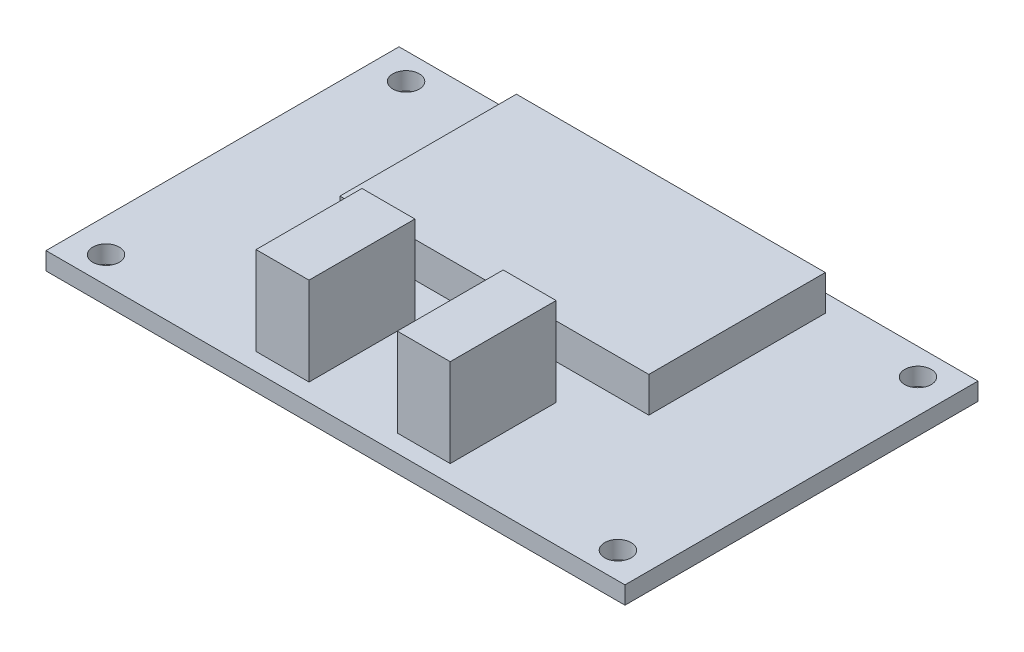
ISO-10303-21;
HEADER;
FILE_DESCRIPTION(('STEP AP214'),'2;1');
FILE_NAME('part.step','',(''),(''),'','','');
FILE_SCHEMA(('AUTOMOTIVE_DESIGN { 1 0 10303 214 1 1 1 1 }'));
ENDSEC;
DATA;
#1=APPLICATION_CONTEXT('core data for automotive mechanical design processes');
#2=APPLICATION_PROTOCOL_DEFINITION('international standard','automotive_design',2000,#1);
#3=PRODUCT_CONTEXT('',#1,'mechanical');
#4=PRODUCT('Part','Part','',(#3));
#5=PRODUCT_RELATED_PRODUCT_CATEGORY('part','',(#4));
#6=PRODUCT_DEFINITION_FORMATION('','',#4);
#7=PRODUCT_DEFINITION_CONTEXT('part definition',#1,'design');
#8=PRODUCT_DEFINITION('design','',#6,#7);
#9=PRODUCT_DEFINITION_SHAPE('','',#8);
#10=(LENGTH_UNIT() NAMED_UNIT(*) SI_UNIT(.MILLI.,.METRE.));
#11=(NAMED_UNIT(*) PLANE_ANGLE_UNIT() SI_UNIT($,.RADIAN.));
#12=(NAMED_UNIT(*) SI_UNIT($,.STERADIAN.) SOLID_ANGLE_UNIT());
#13=UNCERTAINTY_MEASURE_WITH_UNIT(LENGTH_MEASURE(1.E-05),#10,'distance_accuracy_value','');
#14=(GEOMETRIC_REPRESENTATION_CONTEXT(3) GLOBAL_UNCERTAINTY_ASSIGNED_CONTEXT((#13)) GLOBAL_UNIT_ASSIGNED_CONTEXT((#10,
#11,#12)) REPRESENTATION_CONTEXT('',''));
#15=CARTESIAN_POINT('',(0.,0.,0.));
#16=DIRECTION('',(0.,0.,1.));
#17=DIRECTION('',(1.,0.,0.));
#18=AXIS2_PLACEMENT_3D('',#15,#16,#17);
#19=CARTESIAN_POINT('',(0.,2.,0.));
#20=DIRECTION('',(0.,-1.,0.));
#21=DIRECTION('',(0.,0.,-1.));
#22=AXIS2_PLACEMENT_3D('',#19,#20,#21);
#23=PLANE('',#22);
#24=DIRECTION('',(0.,0.,-1.));
#25=VECTOR('',#24,1.);
#26=CARTESIAN_POINT('',(-5.,2.,18.));
#27=LINE('',#26,#25);
#28=CARTESIAN_POINT('',(-5.,2.,18.));
#29=VERTEX_POINT('',#28);
#30=CARTESIAN_POINT('',(-5.,2.,6.));
#31=VERTEX_POINT('',#30);
#32=EDGE_CURVE('E169',#29,#31,#27,.T.);
#33=ORIENTED_EDGE('',*,*,#32,.F.);
#34=DIRECTION('',(1.,0.,0.));
#35=VECTOR('',#34,1.);
#36=CARTESIAN_POINT('',(-11.,2.,18.));
#37=LINE('',#36,#35);
#38=CARTESIAN_POINT('',(-11.,2.,18.));
#39=VERTEX_POINT('',#38);
#40=EDGE_CURVE('E182',#39,#29,#37,.T.);
#41=ORIENTED_EDGE('',*,*,#40,.F.);
#42=DIRECTION('',(0.,0.,1.));
#43=VECTOR('',#42,1.);
#44=CARTESIAN_POINT('',(-11.,2.,18.));
#45=LINE('',#44,#43);
#46=CARTESIAN_POINT('',(-11.,2.,6.));
#47=VERTEX_POINT('',#46);
#48=EDGE_CURVE('E191',#47,#39,#45,.T.);
#49=ORIENTED_EDGE('',*,*,#48,.F.);
#50=DIRECTION('',(-1.,0.,0.));
#51=VECTOR('',#50,1.);
#52=CARTESIAN_POINT('',(-11.,2.,6.));
#53=LINE('',#52,#51);
#54=EDGE_CURVE('E172',#31,#47,#53,.T.);
#55=ORIENTED_EDGE('',*,*,#54,.F.);
#56=EDGE_LOOP('',(#33,#41,#49,#55));
#57=FACE_BOUND('',#56,.T.);
#58=DIRECTION('',(0.,0.,-1.));
#59=VECTOR('',#58,1.);
#60=CARTESIAN_POINT('',(32.8,2.,20.));
#61=LINE('',#60,#59);
#62=CARTESIAN_POINT('',(32.8,2.,20.));
#63=VERTEX_POINT('',#62);
#64=CARTESIAN_POINT('',(32.8,2.,-20.));
#65=VERTEX_POINT('',#64);
#66=EDGE_CURVE('E265',#63,#65,#61,.T.);
#67=ORIENTED_EDGE('',*,*,#66,.T.);
#68=DIRECTION('',(-1.,0.,0.));
#69=VECTOR('',#68,1.);
#70=CARTESIAN_POINT('',(-32.8,2.,-20.));
#71=LINE('',#70,#69);
#72=CARTESIAN_POINT('',(-32.8,2.,-20.));
#73=VERTEX_POINT('',#72);
#74=EDGE_CURVE('E268',#65,#73,#71,.T.);
#75=ORIENTED_EDGE('',*,*,#74,.T.);
#76=DIRECTION('',(0.,0.,1.));
#77=VECTOR('',#76,1.);
#78=CARTESIAN_POINT('',(-32.8,2.,20.));
#79=LINE('',#78,#77);
#80=CARTESIAN_POINT('',(-32.8,2.,20.));
#81=VERTEX_POINT('',#80);
#82=EDGE_CURVE('E271',#73,#81,#79,.T.);
#83=ORIENTED_EDGE('',*,*,#82,.T.);
#84=DIRECTION('',(1.,0.,0.));
#85=VECTOR('',#84,1.);
#86=CARTESIAN_POINT('',(-32.8,2.,20.));
#87=LINE('',#86,#85);
#88=EDGE_CURVE('E273',#81,#63,#87,.T.);
#89=ORIENTED_EDGE('',*,*,#88,.T.);
#90=EDGE_LOOP('',(#67,#75,#83,#89));
#91=FACE_BOUND('',#90,.T.);
#92=CARTESIAN_POINT('',(-29.,2.,-17.));
#93=DIRECTION('',(0.,1.,0.));
#94=DIRECTION('',(0.,0.,1.));
#95=AXIS2_PLACEMENT_3D('',#92,#93,#94);
#96=CIRCLE('',#95,1.5);
#97=CARTESIAN_POINT('',(-29.,2.,-15.5));
#98=VERTEX_POINT('',#97);
#99=EDGE_CURVE('E244',#98,#98,#96,.T.);
#100=ORIENTED_EDGE('',*,*,#99,.F.);
#101=EDGE_LOOP('',(#100));
#102=FACE_BOUND('',#101,.T.);
#103=CARTESIAN_POINT('',(29.,2.,-17.));
#104=DIRECTION('',(0.,1.,0.));
#105=DIRECTION('',(0.,0.,1.));
#106=AXIS2_PLACEMENT_3D('',#103,#104,#105);
#107=CIRCLE('',#106,1.5);
#108=CARTESIAN_POINT('',(29.,2.,-15.5));
#109=VERTEX_POINT('',#108);
#110=EDGE_CURVE('E245',#109,#109,#107,.T.);
#111=ORIENTED_EDGE('',*,*,#110,.F.);
#112=EDGE_LOOP('',(#111));
#113=FACE_BOUND('',#112,.T.);
#114=CARTESIAN_POINT('',(29.,2.,17.));
#115=DIRECTION('',(0.,1.,0.));
#116=DIRECTION('',(0.,0.,1.));
#117=AXIS2_PLACEMENT_3D('',#114,#115,#116);
#118=CIRCLE('',#117,1.5);
#119=CARTESIAN_POINT('',(29.,2.,18.5));
#120=VERTEX_POINT('',#119);
#121=EDGE_CURVE('E251',#120,#120,#118,.T.);
#122=ORIENTED_EDGE('',*,*,#121,.F.);
#123=EDGE_LOOP('',(#122));
#124=FACE_BOUND('',#123,.T.);
#125=CARTESIAN_POINT('',(-29.,2.,17.));
#126=DIRECTION('',(0.,1.,0.));
#127=DIRECTION('',(0.,0.,1.));
#128=AXIS2_PLACEMENT_3D('',#125,#126,#127);
#129=CIRCLE('',#128,1.5);
#130=CARTESIAN_POINT('',(-29.,2.,18.5));
#131=VERTEX_POINT('',#130);
#132=EDGE_CURVE('E240',#131,#131,#129,.T.);
#133=ORIENTED_EDGE('',*,*,#132,.F.);
#134=EDGE_LOOP('',(#133));
#135=FACE_BOUND('',#134,.T.);
#136=DIRECTION('',(0.,0.,-1.));
#137=VECTOR('',#136,1.);
#138=CARTESIAN_POINT('',(17.5,2.,2.));
#139=LINE('',#138,#137);
#140=CARTESIAN_POINT('',(17.5,2.,2.));
#141=VERTEX_POINT('',#140);
#142=CARTESIAN_POINT('',(17.5,2.,-18.));
#143=VERTEX_POINT('',#142);
#144=EDGE_CURVE('E207',#141,#143,#139,.T.);
#145=ORIENTED_EDGE('',*,*,#144,.F.);
#146=DIRECTION('',(1.,0.,0.));
#147=VECTOR('',#146,1.);
#148=CARTESIAN_POINT('',(-17.5,2.,2.));
#149=LINE('',#148,#147);
#150=CARTESIAN_POINT('',(-17.5,2.,2.));
#151=VERTEX_POINT('',#150);
#152=EDGE_CURVE('E212',#151,#141,#149,.T.);
#153=ORIENTED_EDGE('',*,*,#152,.F.);
#154=DIRECTION('',(0.,0.,1.));
#155=VECTOR('',#154,1.);
#156=CARTESIAN_POINT('',(-17.5,2.,2.));
#157=LINE('',#156,#155);
#158=CARTESIAN_POINT('',(-17.5,2.,-18.));
#159=VERTEX_POINT('',#158);
#160=EDGE_CURVE('E224',#159,#151,#157,.T.);
#161=ORIENTED_EDGE('',*,*,#160,.F.);
#162=DIRECTION('',(-1.,0.,0.));
#163=VECTOR('',#162,1.);
#164=CARTESIAN_POINT('',(-17.5,2.,-18.));
#165=LINE('',#164,#163);
#166=EDGE_CURVE('E221',#143,#159,#165,.T.);
#167=ORIENTED_EDGE('',*,*,#166,.F.);
#168=EDGE_LOOP('',(#145,#153,#161,#167));
#169=FACE_BOUND('',#168,.T.);
#170=DIRECTION('',(0.,0.,-1.));
#171=VECTOR('',#170,1.);
#172=CARTESIAN_POINT('',(11.,2.,18.));
#173=LINE('',#172,#171);
#174=CARTESIAN_POINT('',(11.,2.,18.));
#175=VERTEX_POINT('',#174);
#176=CARTESIAN_POINT('',(11.,2.,6.));
#177=VERTEX_POINT('',#176);
#178=EDGE_CURVE('E168',#175,#177,#173,.T.);
#179=ORIENTED_EDGE('',*,*,#178,.F.);
#180=DIRECTION('',(1.,0.,0.));
#181=VECTOR('',#180,1.);
#182=CARTESIAN_POINT('',(5.,2.,18.));
#183=LINE('',#182,#181);
#184=CARTESIAN_POINT('',(5.,2.,18.));
#185=VERTEX_POINT('',#184);
#186=EDGE_CURVE('E165',#185,#175,#183,.T.);
#187=ORIENTED_EDGE('',*,*,#186,.F.);
#188=DIRECTION('',(0.,0.,1.));
#189=VECTOR('',#188,1.);
#190=CARTESIAN_POINT('',(5.,2.,18.));
#191=LINE('',#190,#189);
#192=CARTESIAN_POINT('',(5.,2.,6.));
#193=VERTEX_POINT('',#192);
#194=EDGE_CURVE('E55',#193,#185,#191,.T.);
#195=ORIENTED_EDGE('',*,*,#194,.F.);
#196=DIRECTION('',(-1.,0.,0.));
#197=VECTOR('',#196,1.);
#198=CARTESIAN_POINT('',(5.,2.,6.));
#199=LINE('',#198,#197);
#200=EDGE_CURVE('E50',#177,#193,#199,.T.);
#201=ORIENTED_EDGE('',*,*,#200,.F.);
#202=EDGE_LOOP('',(#179,#187,#195,#201));
#203=FACE_BOUND('',#202,.T.);
#204=ADVANCED_FACE('F35',(#57,#91,#102,#113,#124,#135,#169,#203),#23,.F.);
#205=CARTESIAN_POINT('',(32.8,2.,20.));
#206=DIRECTION('',(-1.,0.,0.));
#207=DIRECTION('',(0.,0.,1.));
#208=AXIS2_PLACEMENT_3D('',#205,#206,#207);
#209=PLANE('',#208);
#210=DIRECTION('',(0.,0.,-1.));
#211=VECTOR('',#210,1.);
#212=CARTESIAN_POINT('',(32.8,0.,20.));
#213=LINE('',#212,#211);
#214=CARTESIAN_POINT('',(32.8,0.,20.));
#215=VERTEX_POINT('',#214);
#216=CARTESIAN_POINT('',(32.8,0.,-20.));
#217=VERTEX_POINT('',#216);
#218=EDGE_CURVE('E262',#215,#217,#213,.T.);
#219=ORIENTED_EDGE('',*,*,#218,.T.);
#220=DIRECTION('',(0.,-1.,0.));
#221=VECTOR('',#220,1.);
#222=CARTESIAN_POINT('',(32.8,2.,-20.));
#223=LINE('',#222,#221);
#224=EDGE_CURVE('E11',#65,#217,#223,.T.);
#225=ORIENTED_EDGE('',*,*,#224,.F.);
#226=ORIENTED_EDGE('',*,*,#66,.F.);
#227=DIRECTION('',(0.,-1.,0.));
#228=VECTOR('',#227,1.);
#229=CARTESIAN_POINT('',(32.8,2.,20.));
#230=LINE('',#229,#228);
#231=EDGE_CURVE('E275',#63,#215,#230,.T.);
#232=ORIENTED_EDGE('',*,*,#231,.T.);
#233=EDGE_LOOP('',(#219,#225,#226,#232));
#234=FACE_BOUND('',#233,.T.);
#235=ADVANCED_FACE('F37',(#234),#209,.F.);
#236=CARTESIAN_POINT('',(-32.8,2.,-20.));
#237=DIRECTION('',(0.,0.,1.));
#238=DIRECTION('',(1.,0.,0.));
#239=AXIS2_PLACEMENT_3D('',#236,#237,#238);
#240=PLANE('',#239);
#241=DIRECTION('',(-1.,0.,0.));
#242=VECTOR('',#241,1.);
#243=CARTESIAN_POINT('',(-32.8,0.,-20.));
#244=LINE('',#243,#242);
#245=CARTESIAN_POINT('',(-32.8,0.,-20.));
#246=VERTEX_POINT('',#245);
#247=EDGE_CURVE('E278',#217,#246,#244,.T.);
#248=ORIENTED_EDGE('',*,*,#247,.T.);
#249=DIRECTION('',(0.,-1.,0.));
#250=VECTOR('',#249,1.);
#251=CARTESIAN_POINT('',(-32.8,2.,-20.));
#252=LINE('',#251,#250);
#253=EDGE_CURVE('E43',#73,#246,#252,.T.);
#254=ORIENTED_EDGE('',*,*,#253,.F.);
#255=ORIENTED_EDGE('',*,*,#74,.F.);
#256=ORIENTED_EDGE('',*,*,#224,.T.);
#257=EDGE_LOOP('',(#248,#254,#255,#256));
#258=FACE_BOUND('',#257,.T.);
#259=ADVANCED_FACE('F308',(#258),#240,.F.);
#260=CARTESIAN_POINT('',(-32.8,2.,20.));
#261=DIRECTION('',(1.,0.,0.));
#262=DIRECTION('',(0.,0.,-1.));
#263=AXIS2_PLACEMENT_3D('',#260,#261,#262);
#264=PLANE('',#263);
#265=DIRECTION('',(0.,0.,1.));
#266=VECTOR('',#265,1.);
#267=CARTESIAN_POINT('',(-32.8,0.,20.));
#268=LINE('',#267,#266);
#269=CARTESIAN_POINT('',(-32.8,0.,20.));
#270=VERTEX_POINT('',#269);
#271=EDGE_CURVE('E280',#246,#270,#268,.T.);
#272=ORIENTED_EDGE('',*,*,#271,.T.);
#273=DIRECTION('',(0.,-1.,0.));
#274=VECTOR('',#273,1.);
#275=CARTESIAN_POINT('',(-32.8,2.,20.));
#276=LINE('',#275,#274);
#277=EDGE_CURVE('E285',#81,#270,#276,.T.);
#278=ORIENTED_EDGE('',*,*,#277,.F.);
#279=ORIENTED_EDGE('',*,*,#82,.F.);
#280=ORIENTED_EDGE('',*,*,#253,.T.);
#281=EDGE_LOOP('',(#272,#278,#279,#280));
#282=FACE_BOUND('',#281,.T.);
#283=ADVANCED_FACE('F292',(#282),#264,.F.);
#284=CARTESIAN_POINT('',(-32.8,2.,20.));
#285=DIRECTION('',(0.,0.,-1.));
#286=DIRECTION('',(-1.,0.,0.));
#287=AXIS2_PLACEMENT_3D('',#284,#285,#286);
#288=PLANE('',#287);
#289=DIRECTION('',(1.,0.,0.));
#290=VECTOR('',#289,1.);
#291=CARTESIAN_POINT('',(-32.8,0.,20.));
#292=LINE('',#291,#290);
#293=EDGE_CURVE('E269',#270,#215,#292,.T.);
#294=ORIENTED_EDGE('',*,*,#293,.T.);
#295=ORIENTED_EDGE('',*,*,#231,.F.);
#296=ORIENTED_EDGE('',*,*,#88,.F.);
#297=ORIENTED_EDGE('',*,*,#277,.T.);
#298=EDGE_LOOP('',(#294,#295,#296,#297));
#299=FACE_BOUND('',#298,.T.);
#300=ADVANCED_FACE('F301',(#299),#288,.F.);
#301=CARTESIAN_POINT('',(0.,0.,0.));
#302=DIRECTION('',(0.,-1.,0.));
#303=DIRECTION('',(0.,0.,-1.));
#304=AXIS2_PLACEMENT_3D('',#301,#302,#303);
#305=PLANE('',#304);
#306=CARTESIAN_POINT('',(-29.,0.,17.));
#307=DIRECTION('',(0.,1.,0.));
#308=DIRECTION('',(0.,0.,1.));
#309=AXIS2_PLACEMENT_3D('',#306,#307,#308);
#310=CIRCLE('',#309,1.5);
#311=CARTESIAN_POINT('',(-29.,0.,18.5));
#312=VERTEX_POINT('',#311);
#313=EDGE_CURVE('E254',#312,#312,#310,.T.);
#314=ORIENTED_EDGE('',*,*,#313,.T.);
#315=EDGE_LOOP('',(#314));
#316=FACE_BOUND('',#315,.T.);
#317=CARTESIAN_POINT('',(29.,0.,17.));
#318=DIRECTION('',(0.,1.,0.));
#319=DIRECTION('',(0.,0.,1.));
#320=AXIS2_PLACEMENT_3D('',#317,#318,#319);
#321=CIRCLE('',#320,1.5);
#322=CARTESIAN_POINT('',(29.,0.,18.5));
#323=VERTEX_POINT('',#322);
#324=EDGE_CURVE('E248',#323,#323,#321,.T.);
#325=ORIENTED_EDGE('',*,*,#324,.T.);
#326=EDGE_LOOP('',(#325));
#327=FACE_BOUND('',#326,.T.);
#328=CARTESIAN_POINT('',(29.,0.,-17.));
#329=DIRECTION('',(0.,1.,0.));
#330=DIRECTION('',(0.,0.,1.));
#331=AXIS2_PLACEMENT_3D('',#328,#329,#330);
#332=CIRCLE('',#331,1.5);
#333=CARTESIAN_POINT('',(29.,0.,-15.5));
#334=VERTEX_POINT('',#333);
#335=EDGE_CURVE('E241',#334,#334,#332,.T.);
#336=ORIENTED_EDGE('',*,*,#335,.T.);
#337=EDGE_LOOP('',(#336));
#338=FACE_BOUND('',#337,.T.);
#339=CARTESIAN_POINT('',(-29.,0.,-17.));
#340=DIRECTION('',(0.,1.,0.));
#341=DIRECTION('',(0.,0.,1.));
#342=AXIS2_PLACEMENT_3D('',#339,#340,#341);
#343=CIRCLE('',#342,1.5);
#344=CARTESIAN_POINT('',(-29.,0.,-15.5));
#345=VERTEX_POINT('',#344);
#346=EDGE_CURVE('E259',#345,#345,#343,.T.);
#347=ORIENTED_EDGE('',*,*,#346,.T.);
#348=EDGE_LOOP('',(#347));
#349=FACE_BOUND('',#348,.T.);
#350=ORIENTED_EDGE('',*,*,#218,.F.);
#351=ORIENTED_EDGE('',*,*,#293,.F.);
#352=ORIENTED_EDGE('',*,*,#271,.F.);
#353=ORIENTED_EDGE('',*,*,#247,.F.);
#354=EDGE_LOOP('',(#350,#351,#352,#353));
#355=FACE_BOUND('',#354,.T.);
#356=ADVANCED_FACE('F298',(#316,#327,#338,#349,#355),#305,.T.);
#357=CARTESIAN_POINT('',(-29.,0.,-17.));
#358=DIRECTION('',(0.,1.,0.));
#359=DIRECTION('',(0.,0.,1.));
#360=AXIS2_PLACEMENT_3D('',#357,#358,#359);
#361=CYLINDRICAL_SURFACE('',#360,1.5);
#362=ORIENTED_EDGE('',*,*,#346,.F.);
#363=EDGE_LOOP('',(#362));
#364=FACE_BOUND('',#363,.T.);
#365=ORIENTED_EDGE('',*,*,#99,.T.);
#366=EDGE_LOOP('',(#365));
#367=FACE_BOUND('',#366,.T.);
#368=ADVANCED_FACE('F322',(#364,#367),#361,.F.);
#369=CARTESIAN_POINT('',(29.,0.,-17.));
#370=DIRECTION('',(0.,1.,0.));
#371=DIRECTION('',(0.,0.,1.));
#372=AXIS2_PLACEMENT_3D('',#369,#370,#371);
#373=CYLINDRICAL_SURFACE('',#372,1.5);
#374=ORIENTED_EDGE('',*,*,#335,.F.);
#375=EDGE_LOOP('',(#374));
#376=FACE_BOUND('',#375,.T.);
#377=ORIENTED_EDGE('',*,*,#110,.T.);
#378=EDGE_LOOP('',(#377));
#379=FACE_BOUND('',#378,.T.);
#380=ADVANCED_FACE('F342',(#376,#379),#373,.F.);
#381=CARTESIAN_POINT('',(29.,0.,17.));
#382=DIRECTION('',(0.,1.,0.));
#383=DIRECTION('',(0.,0.,1.));
#384=AXIS2_PLACEMENT_3D('',#381,#382,#383);
#385=CYLINDRICAL_SURFACE('',#384,1.5);
#386=ORIENTED_EDGE('',*,*,#324,.F.);
#387=EDGE_LOOP('',(#386));
#388=FACE_BOUND('',#387,.T.);
#389=ORIENTED_EDGE('',*,*,#121,.T.);
#390=EDGE_LOOP('',(#389));
#391=FACE_BOUND('',#390,.T.);
#392=ADVANCED_FACE('F349',(#388,#391),#385,.F.);
#393=CARTESIAN_POINT('',(-29.,0.,17.));
#394=DIRECTION('',(0.,1.,0.));
#395=DIRECTION('',(0.,0.,1.));
#396=AXIS2_PLACEMENT_3D('',#393,#394,#395);
#397=CYLINDRICAL_SURFACE('',#396,1.5);
#398=ORIENTED_EDGE('',*,*,#313,.F.);
#399=EDGE_LOOP('',(#398));
#400=FACE_BOUND('',#399,.T.);
#401=ORIENTED_EDGE('',*,*,#132,.T.);
#402=EDGE_LOOP('',(#401));
#403=FACE_BOUND('',#402,.T.);
#404=ADVANCED_FACE('F357',(#400,#403),#397,.F.);
#405=CARTESIAN_POINT('',(17.5,6.,2.));
#406=DIRECTION('',(-1.,0.,0.));
#407=DIRECTION('',(0.,0.,1.));
#408=AXIS2_PLACEMENT_3D('',#405,#406,#407);
#409=PLANE('',#408);
#410=ORIENTED_EDGE('',*,*,#144,.T.);
#411=DIRECTION('',(0.,-1.,0.));
#412=VECTOR('',#411,1.);
#413=CARTESIAN_POINT('',(17.5,6.,-18.));
#414=LINE('',#413,#412);
#415=CARTESIAN_POINT('',(17.5,6.,-18.));
#416=VERTEX_POINT('',#415);
#417=EDGE_CURVE('E237',#416,#143,#414,.T.);
#418=ORIENTED_EDGE('',*,*,#417,.F.);
#419=DIRECTION('',(0.,0.,-1.));
#420=VECTOR('',#419,1.);
#421=CARTESIAN_POINT('',(17.5,6.,2.));
#422=LINE('',#421,#420);
#423=CARTESIAN_POINT('',(17.5,6.,2.));
#424=VERTEX_POINT('',#423);
#425=EDGE_CURVE('E208',#424,#416,#422,.T.);
#426=ORIENTED_EDGE('',*,*,#425,.F.);
#427=DIRECTION('',(0.,-1.,0.));
#428=VECTOR('',#427,1.);
#429=CARTESIAN_POINT('',(17.5,6.,2.));
#430=LINE('',#429,#428);
#431=EDGE_CURVE('E218',#424,#141,#430,.T.);
#432=ORIENTED_EDGE('',*,*,#431,.T.);
#433=EDGE_LOOP('',(#410,#418,#426,#432));
#434=FACE_BOUND('',#433,.T.);
#435=ADVANCED_FACE('F365',(#434),#409,.F.);
#436=CARTESIAN_POINT('',(-17.5,6.,-18.));
#437=DIRECTION('',(0.,0.,1.));
#438=DIRECTION('',(1.,0.,0.));
#439=AXIS2_PLACEMENT_3D('',#436,#437,#438);
#440=PLANE('',#439);
#441=ORIENTED_EDGE('',*,*,#166,.T.);
#442=DIRECTION('',(0.,-1.,0.));
#443=VECTOR('',#442,1.);
#444=CARTESIAN_POINT('',(-17.5,6.,-18.));
#445=LINE('',#444,#443);
#446=CARTESIAN_POINT('',(-17.5,6.,-18.));
#447=VERTEX_POINT('',#446);
#448=EDGE_CURVE('E234',#447,#159,#445,.T.);
#449=ORIENTED_EDGE('',*,*,#448,.F.);
#450=DIRECTION('',(-1.,0.,0.));
#451=VECTOR('',#450,1.);
#452=CARTESIAN_POINT('',(-17.5,6.,-18.));
#453=LINE('',#452,#451);
#454=EDGE_CURVE('E211',#416,#447,#453,.T.);
#455=ORIENTED_EDGE('',*,*,#454,.F.);
#456=ORIENTED_EDGE('',*,*,#417,.T.);
#457=EDGE_LOOP('',(#441,#449,#455,#456));
#458=FACE_BOUND('',#457,.T.);
#459=ADVANCED_FACE('F373',(#458),#440,.F.);
#460=CARTESIAN_POINT('',(-17.5,6.,2.));
#461=DIRECTION('',(1.,0.,0.));
#462=DIRECTION('',(0.,0.,-1.));
#463=AXIS2_PLACEMENT_3D('',#460,#461,#462);
#464=PLANE('',#463);
#465=ORIENTED_EDGE('',*,*,#160,.T.);
#466=DIRECTION('',(0.,-1.,0.));
#467=VECTOR('',#466,1.);
#468=CARTESIAN_POINT('',(-17.5,6.,2.));
#469=LINE('',#468,#467);
#470=CARTESIAN_POINT('',(-17.5,6.,2.));
#471=VERTEX_POINT('',#470);
#472=EDGE_CURVE('E231',#471,#151,#469,.T.);
#473=ORIENTED_EDGE('',*,*,#472,.F.);
#474=DIRECTION('',(0.,0.,1.));
#475=VECTOR('',#474,1.);
#476=CARTESIAN_POINT('',(-17.5,6.,2.));
#477=LINE('',#476,#475);
#478=EDGE_CURVE('E214',#447,#471,#477,.T.);
#479=ORIENTED_EDGE('',*,*,#478,.F.);
#480=ORIENTED_EDGE('',*,*,#448,.T.);
#481=EDGE_LOOP('',(#465,#473,#479,#480));
#482=FACE_BOUND('',#481,.T.);
#483=ADVANCED_FACE('F380',(#482),#464,.F.);
#484=CARTESIAN_POINT('',(-17.5,6.,2.));
#485=DIRECTION('',(0.,0.,-1.));
#486=DIRECTION('',(-1.,0.,0.));
#487=AXIS2_PLACEMENT_3D('',#484,#485,#486);
#488=PLANE('',#487);
#489=ORIENTED_EDGE('',*,*,#152,.T.);
#490=ORIENTED_EDGE('',*,*,#431,.F.);
#491=DIRECTION('',(1.,0.,0.));
#492=VECTOR('',#491,1.);
#493=CARTESIAN_POINT('',(-17.5,6.,2.));
#494=LINE('',#493,#492);
#495=EDGE_CURVE('E216',#471,#424,#494,.T.);
#496=ORIENTED_EDGE('',*,*,#495,.F.);
#497=ORIENTED_EDGE('',*,*,#472,.T.);
#498=EDGE_LOOP('',(#489,#490,#496,#497));
#499=FACE_BOUND('',#498,.T.);
#500=ADVANCED_FACE('F388',(#499),#488,.F.);
#501=CARTESIAN_POINT('',(0.,6.,0.));
#502=DIRECTION('',(0.,-1.,0.));
#503=DIRECTION('',(0.,0.,-1.));
#504=AXIS2_PLACEMENT_3D('',#501,#502,#503);
#505=PLANE('',#504);
#506=ORIENTED_EDGE('',*,*,#425,.T.);
#507=ORIENTED_EDGE('',*,*,#454,.T.);
#508=ORIENTED_EDGE('',*,*,#478,.T.);
#509=ORIENTED_EDGE('',*,*,#495,.T.);
#510=EDGE_LOOP('',(#506,#507,#508,#509));
#511=FACE_BOUND('',#510,.T.);
#512=ADVANCED_FACE('F396',(#511),#505,.F.);
#513=CARTESIAN_POINT('',(-5.,12.,18.));
#514=DIRECTION('',(-1.,0.,0.));
#515=DIRECTION('',(0.,0.,1.));
#516=AXIS2_PLACEMENT_3D('',#513,#514,#515);
#517=PLANE('',#516);
#518=ORIENTED_EDGE('',*,*,#32,.T.);
#519=DIRECTION('',(0.,-1.,0.));
#520=VECTOR('',#519,1.);
#521=CARTESIAN_POINT('',(-5.,12.,6.));
#522=LINE('',#521,#520);
#523=CARTESIAN_POINT('',(-5.,12.,6.));
#524=VERTEX_POINT('',#523);
#525=EDGE_CURVE('E204',#524,#31,#522,.T.);
#526=ORIENTED_EDGE('',*,*,#525,.F.);
#527=DIRECTION('',(0.,0.,-1.));
#528=VECTOR('',#527,1.);
#529=CARTESIAN_POINT('',(-5.,12.,18.));
#530=LINE('',#529,#528);
#531=CARTESIAN_POINT('',(-5.,12.,18.));
#532=VERTEX_POINT('',#531);
#533=EDGE_CURVE('E178',#532,#524,#530,.T.);
#534=ORIENTED_EDGE('',*,*,#533,.F.);
#535=DIRECTION('',(0.,-1.,0.));
#536=VECTOR('',#535,1.);
#537=CARTESIAN_POINT('',(-5.,12.,18.));
#538=LINE('',#537,#536);
#539=EDGE_CURVE('E187',#532,#29,#538,.T.);
#540=ORIENTED_EDGE('',*,*,#539,.T.);
#541=EDGE_LOOP('',(#518,#526,#534,#540));
#542=FACE_BOUND('',#541,.T.);
#543=ADVANCED_FACE('F404',(#542),#517,.F.);
#544=CARTESIAN_POINT('',(-11.,12.,6.));
#545=DIRECTION('',(0.,0.,1.));
#546=DIRECTION('',(1.,0.,0.));
#547=AXIS2_PLACEMENT_3D('',#544,#545,#546);
#548=PLANE('',#547);
#549=ORIENTED_EDGE('',*,*,#54,.T.);
#550=DIRECTION('',(0.,-1.,0.));
#551=VECTOR('',#550,1.);
#552=CARTESIAN_POINT('',(-11.,12.,6.));
#553=LINE('',#552,#551);
#554=CARTESIAN_POINT('',(-11.,12.,6.));
#555=VERTEX_POINT('',#554);
#556=EDGE_CURVE('E201',#555,#47,#553,.T.);
#557=ORIENTED_EDGE('',*,*,#556,.F.);
#558=DIRECTION('',(-1.,0.,0.));
#559=VECTOR('',#558,1.);
#560=CARTESIAN_POINT('',(-11.,12.,6.));
#561=LINE('',#560,#559);
#562=EDGE_CURVE('E181',#524,#555,#561,.T.);
#563=ORIENTED_EDGE('',*,*,#562,.F.);
#564=ORIENTED_EDGE('',*,*,#525,.T.);
#565=EDGE_LOOP('',(#549,#557,#563,#564));
#566=FACE_BOUND('',#565,.T.);
#567=ADVANCED_FACE('F412',(#566),#548,.F.);
#568=CARTESIAN_POINT('',(-11.,12.,18.));
#569=DIRECTION('',(1.,0.,0.));
#570=DIRECTION('',(0.,0.,-1.));
#571=AXIS2_PLACEMENT_3D('',#568,#569,#570);
#572=PLANE('',#571);
#573=ORIENTED_EDGE('',*,*,#48,.T.);
#574=DIRECTION('',(0.,-1.,0.));
#575=VECTOR('',#574,1.);
#576=CARTESIAN_POINT('',(-11.,12.,18.));
#577=LINE('',#576,#575);
#578=CARTESIAN_POINT('',(-11.,12.,18.));
#579=VERTEX_POINT('',#578);
#580=EDGE_CURVE('E198',#579,#39,#577,.T.);
#581=ORIENTED_EDGE('',*,*,#580,.F.);
#582=DIRECTION('',(0.,0.,1.));
#583=VECTOR('',#582,1.);
#584=CARTESIAN_POINT('',(-11.,12.,18.));
#585=LINE('',#584,#583);
#586=EDGE_CURVE('E184',#555,#579,#585,.T.);
#587=ORIENTED_EDGE('',*,*,#586,.F.);
#588=ORIENTED_EDGE('',*,*,#556,.T.);
#589=EDGE_LOOP('',(#573,#581,#587,#588));
#590=FACE_BOUND('',#589,.T.);
#591=ADVANCED_FACE('F420',(#590),#572,.F.);
#592=CARTESIAN_POINT('',(-11.,12.,18.));
#593=DIRECTION('',(0.,0.,-1.));
#594=DIRECTION('',(-1.,0.,0.));
#595=AXIS2_PLACEMENT_3D('',#592,#593,#594);
#596=PLANE('',#595);
#597=ORIENTED_EDGE('',*,*,#40,.T.);
#598=ORIENTED_EDGE('',*,*,#539,.F.);
#599=DIRECTION('',(1.,0.,0.));
#600=VECTOR('',#599,1.);
#601=CARTESIAN_POINT('',(-11.,12.,18.));
#602=LINE('',#601,#600);
#603=EDGE_CURVE('E186',#579,#532,#602,.T.);
#604=ORIENTED_EDGE('',*,*,#603,.F.);
#605=ORIENTED_EDGE('',*,*,#580,.T.);
#606=EDGE_LOOP('',(#597,#598,#604,#605));
#607=FACE_BOUND('',#606,.T.);
#608=ADVANCED_FACE('F428',(#607),#596,.F.);
#609=CARTESIAN_POINT('',(0.,12.,0.));
#610=DIRECTION('',(0.,-1.,0.));
#611=DIRECTION('',(0.,0.,-1.));
#612=AXIS2_PLACEMENT_3D('',#609,#610,#611);
#613=PLANE('',#612);
#614=ORIENTED_EDGE('',*,*,#533,.T.);
#615=ORIENTED_EDGE('',*,*,#562,.T.);
#616=ORIENTED_EDGE('',*,*,#586,.T.);
#617=ORIENTED_EDGE('',*,*,#603,.T.);
#618=EDGE_LOOP('',(#614,#615,#616,#617));
#619=FACE_BOUND('',#618,.T.);
#620=ADVANCED_FACE('F436',(#619),#613,.F.);
#621=CARTESIAN_POINT('',(11.,12.,18.));
#622=DIRECTION('',(-1.,0.,0.));
#623=DIRECTION('',(0.,0.,1.));
#624=AXIS2_PLACEMENT_3D('',#621,#622,#623);
#625=PLANE('',#624);
#626=ORIENTED_EDGE('',*,*,#178,.T.);
#627=DIRECTION('',(0.,-1.,0.));
#628=VECTOR('',#627,1.);
#629=CARTESIAN_POINT('',(11.,12.,6.));
#630=LINE('',#629,#628);
#631=CARTESIAN_POINT('',(11.,12.,6.));
#632=VERTEX_POINT('',#631);
#633=EDGE_CURVE('E149',#632,#177,#630,.T.);
#634=ORIENTED_EDGE('',*,*,#633,.F.);
#635=DIRECTION('',(0.,0.,-1.));
#636=VECTOR('',#635,1.);
#637=CARTESIAN_POINT('',(11.,12.,18.));
#638=LINE('',#637,#636);
#639=CARTESIAN_POINT('',(11.,12.,18.));
#640=VERTEX_POINT('',#639);
#641=EDGE_CURVE('E156',#640,#632,#638,.T.);
#642=ORIENTED_EDGE('',*,*,#641,.F.);
#643=DIRECTION('',(0.,-1.,0.));
#644=VECTOR('',#643,1.);
#645=CARTESIAN_POINT('',(11.,12.,18.));
#646=LINE('',#645,#644);
#647=EDGE_CURVE('E553',#640,#175,#646,.T.);
#648=ORIENTED_EDGE('',*,*,#647,.T.);
#649=EDGE_LOOP('',(#626,#634,#642,#648));
#650=FACE_BOUND('',#649,.T.);
#651=ADVANCED_FACE('F167',(#650),#625,.F.);
#652=CARTESIAN_POINT('',(5.,12.,6.));
#653=DIRECTION('',(0.,0.,1.));
#654=DIRECTION('',(1.,0.,0.));
#655=AXIS2_PLACEMENT_3D('',#652,#653,#654);
#656=PLANE('',#655);
#657=ORIENTED_EDGE('',*,*,#200,.T.);
#658=DIRECTION('',(0.,-1.,0.));
#659=VECTOR('',#658,1.);
#660=CARTESIAN_POINT('',(5.,12.,6.));
#661=LINE('',#660,#659);
#662=CARTESIAN_POINT('',(5.,12.,6.));
#663=VERTEX_POINT('',#662);
#664=EDGE_CURVE('E152',#663,#193,#661,.T.);
#665=ORIENTED_EDGE('',*,*,#664,.F.);
#666=DIRECTION('',(-1.,0.,0.));
#667=VECTOR('',#666,1.);
#668=CARTESIAN_POINT('',(5.,12.,6.));
#669=LINE('',#668,#667);
#670=EDGE_CURVE('E145',#632,#663,#669,.T.);
#671=ORIENTED_EDGE('',*,*,#670,.F.);
#672=ORIENTED_EDGE('',*,*,#633,.T.);
#673=EDGE_LOOP('',(#657,#665,#671,#672));
#674=FACE_BOUND('',#673,.T.);
#675=ADVANCED_FACE('F147',(#674),#656,.F.);
#676=CARTESIAN_POINT('',(5.,12.,18.));
#677=DIRECTION('',(1.,0.,0.));
#678=DIRECTION('',(0.,0.,-1.));
#679=AXIS2_PLACEMENT_3D('',#676,#677,#678);
#680=PLANE('',#679);
#681=ORIENTED_EDGE('',*,*,#194,.T.);
#682=DIRECTION('',(0.,-1.,0.));
#683=VECTOR('',#682,1.);
#684=CARTESIAN_POINT('',(5.,12.,18.));
#685=LINE('',#684,#683);
#686=CARTESIAN_POINT('',(5.,12.,18.));
#687=VERTEX_POINT('',#686);
#688=EDGE_CURVE('E174',#687,#185,#685,.T.);
#689=ORIENTED_EDGE('',*,*,#688,.F.);
#690=DIRECTION('',(0.,0.,1.));
#691=VECTOR('',#690,1.);
#692=CARTESIAN_POINT('',(5.,12.,18.));
#693=LINE('',#692,#691);
#694=EDGE_CURVE('E155',#663,#687,#693,.T.);
#695=ORIENTED_EDGE('',*,*,#694,.F.);
#696=ORIENTED_EDGE('',*,*,#664,.T.);
#697=EDGE_LOOP('',(#681,#689,#695,#696));
#698=FACE_BOUND('',#697,.T.);
#699=ADVANCED_FACE('F457',(#698),#680,.F.);
#700=CARTESIAN_POINT('',(5.,12.,18.));
#701=DIRECTION('',(0.,0.,-1.));
#702=DIRECTION('',(-1.,0.,0.));
#703=AXIS2_PLACEMENT_3D('',#700,#701,#702);
#704=PLANE('',#703);
#705=ORIENTED_EDGE('',*,*,#186,.T.);
#706=ORIENTED_EDGE('',*,*,#647,.F.);
#707=DIRECTION('',(1.,0.,0.));
#708=VECTOR('',#707,1.);
#709=CARTESIAN_POINT('',(5.,12.,18.));
#710=LINE('',#709,#708);
#711=EDGE_CURVE('E161',#687,#640,#710,.T.);
#712=ORIENTED_EDGE('',*,*,#711,.F.);
#713=ORIENTED_EDGE('',*,*,#688,.T.);
#714=EDGE_LOOP('',(#705,#706,#712,#713));
#715=FACE_BOUND('',#714,.T.);
#716=ADVANCED_FACE('F464',(#715),#704,.F.);
#717=CARTESIAN_POINT('',(0.,12.,0.));
#718=DIRECTION('',(0.,-1.,0.));
#719=DIRECTION('',(0.,0.,-1.));
#720=AXIS2_PLACEMENT_3D('',#717,#718,#719);
#721=PLANE('',#720);
#722=ORIENTED_EDGE('',*,*,#641,.T.);
#723=ORIENTED_EDGE('',*,*,#670,.T.);
#724=ORIENTED_EDGE('',*,*,#694,.T.);
#725=ORIENTED_EDGE('',*,*,#711,.T.);
#726=EDGE_LOOP('',(#722,#723,#724,#725));
#727=FACE_BOUND('',#726,.T.);
#728=ADVANCED_FACE('F159',(#727),#721,.F.);
#729=CLOSED_SHELL('',(#204,#235,#259,#283,#300,#356,#368,#380,#392,#404,#435,#459,#483,#500,
#512,#543,#567,#591,#608,#620,#651,#675,#699,#716,#728));
#730=MANIFOLD_SOLID_BREP('B2',#729);
#731=ADVANCED_BREP_SHAPE_REPRESENTATION('',(#18,#730),#14);
#732=SHAPE_DEFINITION_REPRESENTATION(#9,#731);
ENDSEC;
END-ISO-10303-21;
